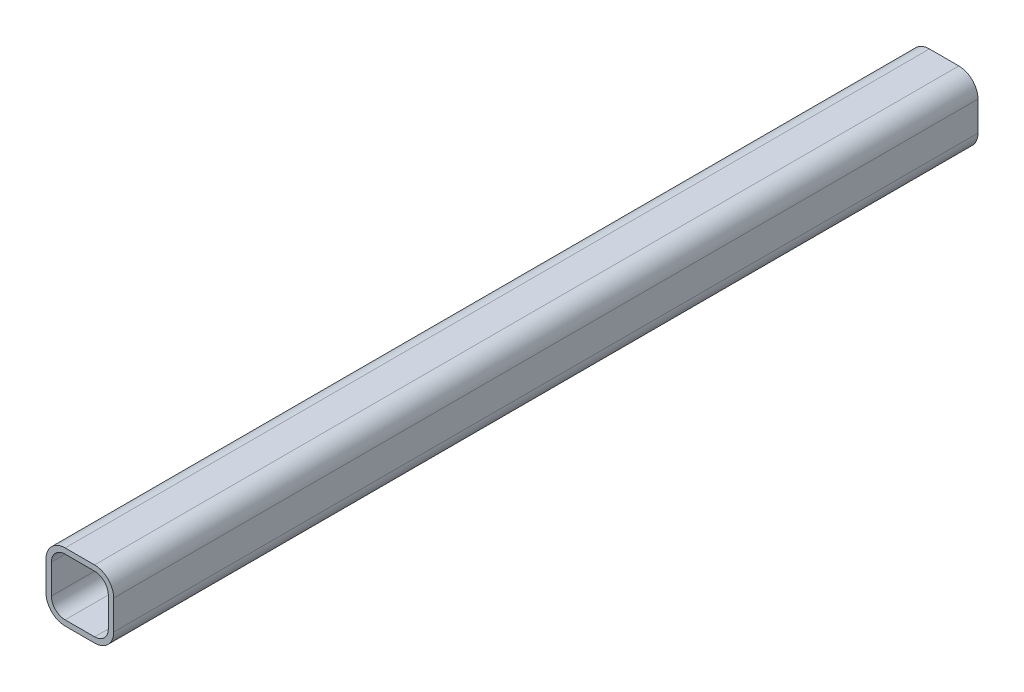
ISO-10303-21;
HEADER;
FILE_DESCRIPTION(('STEP AP214'),'2;1');
FILE_NAME('part.step','',(''),(''),'','','');
FILE_SCHEMA(('AUTOMOTIVE_DESIGN { 1 0 10303 214 1 1 1 1 }'));
ENDSEC;
DATA;
#1=APPLICATION_CONTEXT('core data for automotive mechanical design processes');
#2=APPLICATION_PROTOCOL_DEFINITION('international standard','automotive_design',2000,#1);
#3=PRODUCT_CONTEXT('',#1,'mechanical');
#4=PRODUCT('Part','Part','',(#3));
#5=PRODUCT_RELATED_PRODUCT_CATEGORY('part','',(#4));
#6=PRODUCT_DEFINITION_FORMATION('','',#4);
#7=PRODUCT_DEFINITION_CONTEXT('part definition',#1,'design');
#8=PRODUCT_DEFINITION('design','',#6,#7);
#9=PRODUCT_DEFINITION_SHAPE('','',#8);
#10=(LENGTH_UNIT() NAMED_UNIT(*) SI_UNIT(.MILLI.,.METRE.));
#11=(NAMED_UNIT(*) PLANE_ANGLE_UNIT() SI_UNIT($,.RADIAN.));
#12=(NAMED_UNIT(*) SI_UNIT($,.STERADIAN.) SOLID_ANGLE_UNIT());
#13=UNCERTAINTY_MEASURE_WITH_UNIT(LENGTH_MEASURE(1.E-05),#10,'distance_accuracy_value','');
#14=(GEOMETRIC_REPRESENTATION_CONTEXT(3) GLOBAL_UNCERTAINTY_ASSIGNED_CONTEXT((#13)) GLOBAL_UNIT_ASSIGNED_CONTEXT((#10,
#11,#12)) REPRESENTATION_CONTEXT('',''));
#15=CARTESIAN_POINT('',(0.,0.,0.));
#16=DIRECTION('',(0.,0.,1.));
#17=DIRECTION('',(1.,0.,0.));
#18=AXIS2_PLACEMENT_3D('',#15,#16,#17);
#19=CARTESIAN_POINT('',(-11.938,-11.938,-152.4));
#20=DIRECTION('',(0.,0.,1.));
#21=DIRECTION('',(1.,0.,0.));
#22=AXIS2_PLACEMENT_3D('',#19,#20,#21);
#23=PLANE('',#22);
#24=DIRECTION('',(0.,1.,0.));
#25=VECTOR('',#24,1.);
#26=CARTESIAN_POINT('',(-10.033,0.,-152.4));
#27=LINE('',#26,#25);
#28=CARTESIAN_POINT('',(-10.033,-5.19112500043521,-152.4));
#29=VERTEX_POINT('',#28);
#30=CARTESIAN_POINT('',(-10.033,5.19112499999956,-152.4));
#31=VERTEX_POINT('',#30);
#32=EDGE_CURVE('E157',#29,#31,#27,.T.);
#33=ORIENTED_EDGE('',*,*,#32,.F.);
#34=CARTESIAN_POINT('',(-5.191125,-5.19112500000087,-152.4));
#35=DIRECTION('',(0.,0.,-1.));
#36=DIRECTION('',(0.,1.,0.));
#37=AXIS2_PLACEMENT_3D('',#34,#35,#36);
#38=CIRCLE('',#37,4.841875);
#39=CARTESIAN_POINT('',(-5.19112499906869,-10.033,-152.4));
#40=VERTEX_POINT('',#39);
#41=EDGE_CURVE('E208',#40,#29,#38,.T.);
#42=ORIENTED_EDGE('',*,*,#41,.F.);
#43=DIRECTION('',(-1.,0.,0.));
#44=VECTOR('',#43,1.);
#45=CARTESIAN_POINT('',(0.,-10.033,-152.4));
#46=LINE('',#45,#44);
#47=CARTESIAN_POINT('',(5.191125,-10.033,-152.4));
#48=VERTEX_POINT('',#47);
#49=EDGE_CURVE('E153',#48,#40,#46,.T.);
#50=ORIENTED_EDGE('',*,*,#49,.F.);
#51=CARTESIAN_POINT('',(5.191125,-5.19112500000087,-152.4));
#52=DIRECTION('',(0.,0.,-1.));
#53=DIRECTION('',(0.,1.,0.));
#54=AXIS2_PLACEMENT_3D('',#51,#52,#53);
#55=CIRCLE('',#54,4.841875);
#56=CARTESIAN_POINT('',(10.033,-5.19112500099352,-152.4));
#57=VERTEX_POINT('',#56);
#58=EDGE_CURVE('E212',#57,#48,#55,.T.);
#59=ORIENTED_EDGE('',*,*,#58,.F.);
#60=DIRECTION('',(0.,-1.,0.));
#61=VECTOR('',#60,1.);
#62=CARTESIAN_POINT('',(10.033,0.,-152.4));
#63=LINE('',#62,#61);
#64=CARTESIAN_POINT('',(10.033,5.19112499999956,-152.4));
#65=VERTEX_POINT('',#64);
#66=EDGE_CURVE('E162',#65,#57,#63,.T.);
#67=ORIENTED_EDGE('',*,*,#66,.F.);
#68=CARTESIAN_POINT('',(5.191125,5.19112499999913,-152.4));
#69=DIRECTION('',(0.,0.,-1.));
#70=DIRECTION('',(0.,1.,0.));
#71=AXIS2_PLACEMENT_3D('',#68,#69,#70);
#72=CIRCLE('',#71,4.841875);
#73=CARTESIAN_POINT('',(5.19112500049654,10.033,-152.4));
#74=VERTEX_POINT('',#73);
#75=EDGE_CURVE('E215',#74,#65,#72,.T.);
#76=ORIENTED_EDGE('',*,*,#75,.F.);
#77=DIRECTION('',(1.,0.,0.));
#78=VECTOR('',#77,1.);
#79=CARTESIAN_POINT('',(0.,10.033,-152.4));
#80=LINE('',#79,#78);
#81=CARTESIAN_POINT('',(-5.191125,10.033,-152.4));
#82=VERTEX_POINT('',#81);
#83=EDGE_CURVE('E167',#82,#74,#80,.T.);
#84=ORIENTED_EDGE('',*,*,#83,.F.);
#85=CARTESIAN_POINT('',(-5.191125,5.19112499999913,-152.4));
#86=DIRECTION('',(0.,0.,-1.));
#87=DIRECTION('',(0.,1.,0.));
#88=AXIS2_PLACEMENT_3D('',#85,#86,#87);
#89=CIRCLE('',#88,4.841875);
#90=EDGE_CURVE('E160',#31,#82,#89,.T.);
#91=ORIENTED_EDGE('',*,*,#90,.F.);
#92=EDGE_LOOP('',(#33,#42,#50,#59,#67,#76,#84,#91));
#93=FACE_BOUND('',#92,.T.);
#94=DIRECTION('',(0.,-1.,0.));
#95=VECTOR('',#94,1.);
#96=CARTESIAN_POINT('',(11.938,0.,-152.4));
#97=LINE('',#96,#95);
#98=CARTESIAN_POINT('',(11.938,5.19112499999969,-152.4));
#99=VERTEX_POINT('',#98);
#100=CARTESIAN_POINT('',(11.938,-5.19112500000031,-152.4));
#101=VERTEX_POINT('',#100);
#102=EDGE_CURVE('E161',#99,#101,#97,.T.);
#103=ORIENTED_EDGE('',*,*,#102,.T.);
#104=CARTESIAN_POINT('',(5.191125,-5.19112500000063,-152.4));
#105=DIRECTION('',(0.,0.,-1.));
#106=DIRECTION('',(0.,1.,0.));
#107=AXIS2_PLACEMENT_3D('',#104,#105,#106);
#108=CIRCLE('',#107,6.746875);
#109=CARTESIAN_POINT('',(5.19112500129773,-11.938,-152.4));
#110=VERTEX_POINT('',#109);
#111=EDGE_CURVE('E220',#101,#110,#108,.T.);
#112=ORIENTED_EDGE('',*,*,#111,.T.);
#113=DIRECTION('',(-1.,0.,0.));
#114=VECTOR('',#113,1.);
#115=CARTESIAN_POINT('',(0.,-11.938,-152.4));
#116=LINE('',#115,#114);
#117=CARTESIAN_POINT('',(-5.191125,-11.938,-152.4));
#118=VERTEX_POINT('',#117);
#119=EDGE_CURVE('E173',#110,#118,#116,.T.);
#120=ORIENTED_EDGE('',*,*,#119,.T.);
#121=CARTESIAN_POINT('',(-5.191125,-5.19112500000063,-152.4));
#122=DIRECTION('',(0.,0.,-1.));
#123=DIRECTION('',(0.,1.,0.));
#124=AXIS2_PLACEMENT_3D('',#121,#122,#123);
#125=CIRCLE('',#124,6.746875);
#126=CARTESIAN_POINT('',(-11.938,-5.19112500060614,-152.4));
#127=VERTEX_POINT('',#126);
#128=EDGE_CURVE('E224',#118,#127,#125,.T.);
#129=ORIENTED_EDGE('',*,*,#128,.T.);
#130=DIRECTION('',(0.,1.,0.));
#131=VECTOR('',#130,1.);
#132=CARTESIAN_POINT('',(-11.938,0.,-152.4));
#133=LINE('',#132,#131);
#134=CARTESIAN_POINT('',(-11.938,5.19112499999969,-152.4));
#135=VERTEX_POINT('',#134);
#136=EDGE_CURVE('E178',#127,#135,#133,.T.);
#137=ORIENTED_EDGE('',*,*,#136,.T.);
#138=CARTESIAN_POINT('',(-5.191125,5.19112499999937,-152.4));
#139=DIRECTION('',(0.,0.,-1.));
#140=DIRECTION('',(0.,1.,0.));
#141=AXIS2_PLACEMENT_3D('',#138,#139,#140);
#142=CIRCLE('',#141,6.746875);
#143=CARTESIAN_POINT('',(-5.1911249993081,11.938,-152.4));
#144=VERTEX_POINT('',#143);
#145=EDGE_CURVE('E140',#135,#144,#142,.T.);
#146=ORIENTED_EDGE('',*,*,#145,.T.);
#147=DIRECTION('',(1.,0.,0.));
#148=VECTOR('',#147,1.);
#149=CARTESIAN_POINT('',(0.,11.938,-152.4));
#150=LINE('',#149,#148);
#151=CARTESIAN_POINT('',(5.191125,11.938,-152.4));
#152=VERTEX_POINT('',#151);
#153=EDGE_CURVE('E138',#144,#152,#150,.T.);
#154=ORIENTED_EDGE('',*,*,#153,.T.);
#155=CARTESIAN_POINT('',(5.191125,5.19112499999937,-152.4));
#156=DIRECTION('',(0.,0.,-1.));
#157=DIRECTION('',(0.,1.,0.));
#158=AXIS2_PLACEMENT_3D('',#155,#156,#157);
#159=CIRCLE('',#158,6.746875);
#160=EDGE_CURVE('E19',#152,#99,#159,.T.);
#161=ORIENTED_EDGE('',*,*,#160,.T.);
#162=EDGE_LOOP('',(#103,#112,#120,#129,#137,#146,#154,#161));
#163=FACE_BOUND('',#162,.T.);
#164=ADVANCED_FACE('F15',(#93,#163),#23,.F.);
#165=CARTESIAN_POINT('',(5.191125,5.191125,152.4));
#166=DIRECTION('',(0.,0.,-1.));
#167=DIRECTION('',(0.,1.,0.));
#168=AXIS2_PLACEMENT_3D('',#165,#166,#167);
#169=CYLINDRICAL_SURFACE('',#168,6.746875);
#170=DIRECTION('',(0.,0.,1.));
#171=VECTOR('',#170,1.);
#172=CARTESIAN_POINT('',(5.191125,11.938,0.));
#173=LINE('',#172,#171);
#174=CARTESIAN_POINT('',(5.191125,11.938,152.4));
#175=VERTEX_POINT('',#174);
#176=EDGE_CURVE('E130',#152,#175,#173,.T.);
#177=ORIENTED_EDGE('',*,*,#176,.T.);
#178=CARTESIAN_POINT('',(5.191125,5.191125,152.4));
#179=DIRECTION('',(0.,0.,-1.));
#180=DIRECTION('',(0.,1.,0.));
#181=AXIS2_PLACEMENT_3D('',#178,#179,#180);
#182=CIRCLE('',#181,6.746875);
#183=CARTESIAN_POINT('',(11.938,5.191125,152.4));
#184=VERTEX_POINT('',#183);
#185=EDGE_CURVE('E206',#184,#175,#182,.F.);
#186=ORIENTED_EDGE('',*,*,#185,.F.);
#187=DIRECTION('',(0.,0.,-1.));
#188=VECTOR('',#187,1.);
#189=CARTESIAN_POINT('',(11.938,5.191125,0.));
#190=LINE('',#189,#188);
#191=EDGE_CURVE('E133',#184,#99,#190,.T.);
#192=ORIENTED_EDGE('',*,*,#191,.T.);
#193=ORIENTED_EDGE('',*,*,#160,.F.);
#194=EDGE_LOOP('',(#177,#186,#192,#193));
#195=FACE_BOUND('',#194,.T.);
#196=ADVANCED_FACE('F128',(#195),#169,.T.);
#197=CARTESIAN_POINT('',(-5.191125,11.938,152.4));
#198=DIRECTION('',(0.,-1.,0.));
#199=DIRECTION('',(0.,0.,-1.));
#200=AXIS2_PLACEMENT_3D('',#197,#198,#199);
#201=PLANE('',#200);
#202=DIRECTION('',(0.,0.,-1.));
#203=VECTOR('',#202,1.);
#204=CARTESIAN_POINT('',(-5.19112499861619,11.938,0.));
#205=LINE('',#204,#203);
#206=CARTESIAN_POINT('',(-5.1911249993081,11.938,152.4));
#207=VERTEX_POINT('',#206);
#208=EDGE_CURVE('E143',#144,#207,#205,.F.);
#209=ORIENTED_EDGE('',*,*,#208,.T.);
#210=DIRECTION('',(-1.,0.,0.));
#211=VECTOR('',#210,1.);
#212=CARTESIAN_POINT('',(0.,11.938,152.4));
#213=LINE('',#212,#211);
#214=EDGE_CURVE('E147',#175,#207,#213,.T.);
#215=ORIENTED_EDGE('',*,*,#214,.F.);
#216=ORIENTED_EDGE('',*,*,#176,.F.);
#217=ORIENTED_EDGE('',*,*,#153,.F.);
#218=EDGE_LOOP('',(#209,#215,#216,#217));
#219=FACE_BOUND('',#218,.T.);
#220=ADVANCED_FACE('F145',(#219),#201,.F.);
#221=CARTESIAN_POINT('',(-5.191125,5.191125,152.4));
#222=DIRECTION('',(0.,0.,-1.));
#223=DIRECTION('',(0.,1.,0.));
#224=AXIS2_PLACEMENT_3D('',#221,#222,#223);
#225=CYLINDRICAL_SURFACE('',#224,6.746875);
#226=DIRECTION('',(0.,0.,1.));
#227=VECTOR('',#226,1.);
#228=CARTESIAN_POINT('',(-11.938,5.191125,0.));
#229=LINE('',#228,#227);
#230=CARTESIAN_POINT('',(-11.938,5.191125,152.4));
#231=VERTEX_POINT('',#230);
#232=EDGE_CURVE('E180',#135,#231,#229,.T.);
#233=ORIENTED_EDGE('',*,*,#232,.T.);
#234=CARTESIAN_POINT('',(-5.191125,5.191125,152.4));
#235=DIRECTION('',(0.,0.,-1.));
#236=DIRECTION('',(0.,1.,0.));
#237=AXIS2_PLACEMENT_3D('',#234,#235,#236);
#238=CIRCLE('',#237,6.746875);
#239=EDGE_CURVE('E203',#207,#231,#238,.F.);
#240=ORIENTED_EDGE('',*,*,#239,.F.);
#241=ORIENTED_EDGE('',*,*,#208,.F.);
#242=ORIENTED_EDGE('',*,*,#145,.F.);
#243=EDGE_LOOP('',(#233,#240,#241,#242));
#244=FACE_BOUND('',#243,.T.);
#245=ADVANCED_FACE('F228',(#244),#225,.T.);
#246=CARTESIAN_POINT('',(-11.938,-5.191125,152.4));
#247=DIRECTION('',(1.,0.,0.));
#248=DIRECTION('',(0.,0.,-1.));
#249=AXIS2_PLACEMENT_3D('',#246,#247,#248);
#250=PLANE('',#249);
#251=DIRECTION('',(0.,0.,-1.));
#252=VECTOR('',#251,1.);
#253=CARTESIAN_POINT('',(-11.938,-5.19112500121165,0.));
#254=LINE('',#253,#252);
#255=CARTESIAN_POINT('',(-11.938,-5.19112500060583,152.4));
#256=VERTEX_POINT('',#255);
#257=EDGE_CURVE('E179',#127,#256,#254,.F.);
#258=ORIENTED_EDGE('',*,*,#257,.T.);
#259=DIRECTION('',(0.,-1.,0.));
#260=VECTOR('',#259,1.);
#261=CARTESIAN_POINT('',(-11.938,0.,152.4));
#262=LINE('',#261,#260);
#263=EDGE_CURVE('E202',#231,#256,#262,.T.);
#264=ORIENTED_EDGE('',*,*,#263,.F.);
#265=ORIENTED_EDGE('',*,*,#232,.F.);
#266=ORIENTED_EDGE('',*,*,#136,.F.);
#267=EDGE_LOOP('',(#258,#264,#265,#266));
#268=FACE_BOUND('',#267,.T.);
#269=ADVANCED_FACE('F260',(#268),#250,.F.);
#270=CARTESIAN_POINT('',(-5.191125,-5.191125,152.4));
#271=DIRECTION('',(0.,0.,-1.));
#272=DIRECTION('',(0.,1.,0.));
#273=AXIS2_PLACEMENT_3D('',#270,#271,#272);
#274=CYLINDRICAL_SURFACE('',#273,6.746875);
#275=DIRECTION('',(0.,0.,1.));
#276=VECTOR('',#275,1.);
#277=CARTESIAN_POINT('',(-5.191125,-11.938,0.));
#278=LINE('',#277,#276);
#279=CARTESIAN_POINT('',(-5.191125,-11.938,152.4));
#280=VERTEX_POINT('',#279);
#281=EDGE_CURVE('E177',#118,#280,#278,.T.);
#282=ORIENTED_EDGE('',*,*,#281,.T.);
#283=CARTESIAN_POINT('',(-5.191125,-5.191125,152.4));
#284=DIRECTION('',(0.,0.,-1.));
#285=DIRECTION('',(0.,1.,0.));
#286=AXIS2_PLACEMENT_3D('',#283,#284,#285);
#287=CIRCLE('',#286,6.746875);
#288=EDGE_CURVE('E199',#256,#280,#287,.F.);
#289=ORIENTED_EDGE('',*,*,#288,.F.);
#290=ORIENTED_EDGE('',*,*,#257,.F.);
#291=ORIENTED_EDGE('',*,*,#128,.F.);
#292=EDGE_LOOP('',(#282,#289,#290,#291));
#293=FACE_BOUND('',#292,.T.);
#294=ADVANCED_FACE('F262',(#293),#274,.T.);
#295=CARTESIAN_POINT('',(-5.191125,-11.938,-152.4));
#296=DIRECTION('',(0.,1.,0.));
#297=DIRECTION('',(0.,0.,1.));
#298=AXIS2_PLACEMENT_3D('',#295,#296,#297);
#299=PLANE('',#298);
#300=DIRECTION('',(0.,0.,-1.));
#301=VECTOR('',#300,1.);
#302=CARTESIAN_POINT('',(5.19112500259545,-11.938,0.));
#303=LINE('',#302,#301);
#304=CARTESIAN_POINT('',(5.19112500129773,-11.938,152.4));
#305=VERTEX_POINT('',#304);
#306=EDGE_CURVE('E176',#110,#305,#303,.F.);
#307=ORIENTED_EDGE('',*,*,#306,.T.);
#308=DIRECTION('',(1.,0.,0.));
#309=VECTOR('',#308,1.);
#310=CARTESIAN_POINT('',(0.,-11.938,152.4));
#311=LINE('',#310,#309);
#312=EDGE_CURVE('E198',#280,#305,#311,.T.);
#313=ORIENTED_EDGE('',*,*,#312,.F.);
#314=ORIENTED_EDGE('',*,*,#281,.F.);
#315=ORIENTED_EDGE('',*,*,#119,.F.);
#316=EDGE_LOOP('',(#307,#313,#314,#315));
#317=FACE_BOUND('',#316,.T.);
#318=ADVANCED_FACE('F318',(#317),#299,.F.);
#319=CARTESIAN_POINT('',(5.191125,-5.191125,152.4));
#320=DIRECTION('',(0.,0.,-1.));
#321=DIRECTION('',(0.,1.,0.));
#322=AXIS2_PLACEMENT_3D('',#319,#320,#321);
#323=CYLINDRICAL_SURFACE('',#322,6.746875);
#324=DIRECTION('',(0.,0.,1.));
#325=VECTOR('',#324,1.);
#326=CARTESIAN_POINT('',(11.938,-5.191125,0.));
#327=LINE('',#326,#325);
#328=CARTESIAN_POINT('',(11.938,-5.191125,152.4));
#329=VERTEX_POINT('',#328);
#330=EDGE_CURVE('E223',#101,#329,#327,.T.);
#331=ORIENTED_EDGE('',*,*,#330,.T.);
#332=CARTESIAN_POINT('',(5.191125,-5.191125,152.4));
#333=DIRECTION('',(0.,0.,-1.));
#334=DIRECTION('',(0.,1.,0.));
#335=AXIS2_PLACEMENT_3D('',#332,#333,#334);
#336=CIRCLE('',#335,6.746875);
#337=EDGE_CURVE('E194',#305,#329,#336,.F.);
#338=ORIENTED_EDGE('',*,*,#337,.F.);
#339=ORIENTED_EDGE('',*,*,#306,.F.);
#340=ORIENTED_EDGE('',*,*,#111,.F.);
#341=EDGE_LOOP('',(#331,#338,#339,#340));
#342=FACE_BOUND('',#341,.T.);
#343=ADVANCED_FACE('F314',(#342),#323,.T.);
#344=CARTESIAN_POINT('',(11.938,-5.191125,-152.4));
#345=DIRECTION('',(-1.,0.,0.));
#346=DIRECTION('',(0.,0.,1.));
#347=AXIS2_PLACEMENT_3D('',#344,#345,#346);
#348=PLANE('',#347);
#349=ORIENTED_EDGE('',*,*,#191,.F.);
#350=DIRECTION('',(0.,1.,0.));
#351=VECTOR('',#350,1.);
#352=CARTESIAN_POINT('',(11.938,0.,152.4));
#353=LINE('',#352,#351);
#354=EDGE_CURVE('E197',#329,#184,#353,.T.);
#355=ORIENTED_EDGE('',*,*,#354,.F.);
#356=ORIENTED_EDGE('',*,*,#330,.F.);
#357=ORIENTED_EDGE('',*,*,#102,.F.);
#358=EDGE_LOOP('',(#349,#355,#356,#357));
#359=FACE_BOUND('',#358,.T.);
#360=ADVANCED_FACE('F317',(#359),#348,.F.);
#361=CARTESIAN_POINT('',(-10.033,-5.191125,152.4));
#362=DIRECTION('',(1.,0.,0.));
#363=DIRECTION('',(0.,0.,-1.));
#364=AXIS2_PLACEMENT_3D('',#361,#362,#363);
#365=PLANE('',#364);
#366=DIRECTION('',(0.,1.,0.));
#367=VECTOR('',#366,1.);
#368=CARTESIAN_POINT('',(-10.033000001016,0.,152.4));
#369=LINE('',#368,#367);
#370=CARTESIAN_POINT('',(-10.033000000508,-5.19112500043477,152.4));
#371=VERTEX_POINT('',#370);
#372=CARTESIAN_POINT('',(-10.033000000508,5.191125,152.4));
#373=VERTEX_POINT('',#372);
#374=EDGE_CURVE('E193',#371,#373,#369,.T.);
#375=ORIENTED_EDGE('',*,*,#374,.F.);
#376=DIRECTION('',(0.,0.,-1.));
#377=VECTOR('',#376,1.);
#378=CARTESIAN_POINT('',(-10.033,-5.19112500086954,0.));
#379=LINE('',#378,#377);
#380=EDGE_CURVE('E211',#29,#371,#379,.F.);
#381=ORIENTED_EDGE('',*,*,#380,.F.);
#382=ORIENTED_EDGE('',*,*,#32,.T.);
#383=DIRECTION('',(0.,0.,1.));
#384=VECTOR('',#383,1.);
#385=CARTESIAN_POINT('',(-10.033,5.191125,0.));
#386=LINE('',#385,#384);
#387=EDGE_CURVE('E171',#373,#31,#386,.F.);
#388=ORIENTED_EDGE('',*,*,#387,.F.);
#389=EDGE_LOOP('',(#375,#381,#382,#388));
#390=FACE_BOUND('',#389,.T.);
#391=ADVANCED_FACE('F297',(#390),#365,.T.);
#392=CARTESIAN_POINT('',(-5.191125,5.191125,152.4));
#393=DIRECTION('',(0.,0.,-1.));
#394=DIRECTION('',(0.,1.,0.));
#395=AXIS2_PLACEMENT_3D('',#392,#393,#394);
#396=CYLINDRICAL_SURFACE('',#395,4.841875);
#397=CARTESIAN_POINT('',(-5.191125,5.191125,152.4));
#398=DIRECTION('',(0.,0.,-1.));
#399=DIRECTION('',(0.,1.,0.));
#400=AXIS2_PLACEMENT_3D('',#397,#398,#399);
#401=CIRCLE('',#400,4.841875);
#402=CARTESIAN_POINT('',(-5.191125,10.033000000508,152.4));
#403=VERTEX_POINT('',#402);
#404=EDGE_CURVE('E190',#373,#403,#401,.T.);
#405=ORIENTED_EDGE('',*,*,#404,.F.);
#406=ORIENTED_EDGE('',*,*,#387,.T.);
#407=ORIENTED_EDGE('',*,*,#90,.T.);
#408=DIRECTION('',(0.,0.,-1.));
#409=VECTOR('',#408,1.);
#410=CARTESIAN_POINT('',(-5.191125,10.033,0.));
#411=LINE('',#410,#409);
#412=EDGE_CURVE('E170',#403,#82,#411,.T.);
#413=ORIENTED_EDGE('',*,*,#412,.F.);
#414=EDGE_LOOP('',(#405,#406,#407,#413));
#415=FACE_BOUND('',#414,.T.);
#416=ADVANCED_FACE('F294',(#415),#396,.F.);
#417=CARTESIAN_POINT('',(-5.191125,10.033,152.4));
#418=DIRECTION('',(0.,-1.,0.));
#419=DIRECTION('',(0.,0.,-1.));
#420=AXIS2_PLACEMENT_3D('',#417,#418,#419);
#421=PLANE('',#420);
#422=DIRECTION('',(1.,0.,0.));
#423=VECTOR('',#422,1.);
#424=CARTESIAN_POINT('',(0.,10.033000001016,152.4));
#425=LINE('',#424,#423);
#426=CARTESIAN_POINT('',(5.19112500049654,10.033000000508,152.4));
#427=VERTEX_POINT('',#426);
#428=EDGE_CURVE('E189',#403,#427,#425,.T.);
#429=ORIENTED_EDGE('',*,*,#428,.F.);
#430=ORIENTED_EDGE('',*,*,#412,.T.);
#431=ORIENTED_EDGE('',*,*,#83,.T.);
#432=DIRECTION('',(0.,0.,1.));
#433=VECTOR('',#432,1.);
#434=CARTESIAN_POINT('',(5.19112500099309,10.033,0.));
#435=LINE('',#434,#433);
#436=EDGE_CURVE('E166',#427,#74,#435,.F.);
#437=ORIENTED_EDGE('',*,*,#436,.F.);
#438=EDGE_LOOP('',(#429,#430,#431,#437));
#439=FACE_BOUND('',#438,.T.);
#440=ADVANCED_FACE('F291',(#439),#421,.T.);
#441=CARTESIAN_POINT('',(5.191125,5.191125,152.4));
#442=DIRECTION('',(0.,0.,-1.));
#443=DIRECTION('',(0.,1.,0.));
#444=AXIS2_PLACEMENT_3D('',#441,#442,#443);
#445=CYLINDRICAL_SURFACE('',#444,4.841875);
#446=CARTESIAN_POINT('',(5.191125,5.191125,152.4));
#447=DIRECTION('',(0.,0.,-1.));
#448=DIRECTION('',(0.,1.,0.));
#449=AXIS2_PLACEMENT_3D('',#446,#447,#448);
#450=CIRCLE('',#449,4.841875);
#451=CARTESIAN_POINT('',(10.033000000508,5.191125,152.4));
#452=VERTEX_POINT('',#451);
#453=EDGE_CURVE('E186',#427,#452,#450,.T.);
#454=ORIENTED_EDGE('',*,*,#453,.F.);
#455=ORIENTED_EDGE('',*,*,#436,.T.);
#456=ORIENTED_EDGE('',*,*,#75,.T.);
#457=DIRECTION('',(0.,0.,-1.));
#458=VECTOR('',#457,1.);
#459=CARTESIAN_POINT('',(10.033,5.191125,0.));
#460=LINE('',#459,#458);
#461=EDGE_CURVE('E165',#452,#65,#460,.T.);
#462=ORIENTED_EDGE('',*,*,#461,.F.);
#463=EDGE_LOOP('',(#454,#455,#456,#462));
#464=FACE_BOUND('',#463,.T.);
#465=ADVANCED_FACE('F288',(#464),#445,.F.);
#466=CARTESIAN_POINT('',(10.033,-5.191125,-152.4));
#467=DIRECTION('',(-1.,0.,0.));
#468=DIRECTION('',(0.,0.,1.));
#469=AXIS2_PLACEMENT_3D('',#466,#467,#468);
#470=PLANE('',#469);
#471=DIRECTION('',(0.,-1.,0.));
#472=VECTOR('',#471,1.);
#473=CARTESIAN_POINT('',(10.033000001016,0.,152.4));
#474=LINE('',#473,#472);
#475=CARTESIAN_POINT('',(10.033000000508,-5.19112500099309,152.4));
#476=VERTEX_POINT('',#475);
#477=EDGE_CURVE('E185',#452,#476,#474,.T.);
#478=ORIENTED_EDGE('',*,*,#477,.F.);
#479=ORIENTED_EDGE('',*,*,#461,.T.);
#480=ORIENTED_EDGE('',*,*,#66,.T.);
#481=DIRECTION('',(0.,0.,1.));
#482=VECTOR('',#481,1.);
#483=CARTESIAN_POINT('',(10.033,-5.19112500198617,0.));
#484=LINE('',#483,#482);
#485=EDGE_CURVE('E156',#476,#57,#484,.F.);
#486=ORIENTED_EDGE('',*,*,#485,.F.);
#487=EDGE_LOOP('',(#478,#479,#480,#486));
#488=FACE_BOUND('',#487,.T.);
#489=ADVANCED_FACE('F285',(#488),#470,.T.);
#490=CARTESIAN_POINT('',(5.191125,-5.191125,152.4));
#491=DIRECTION('',(0.,0.,-1.));
#492=DIRECTION('',(0.,1.,0.));
#493=AXIS2_PLACEMENT_3D('',#490,#491,#492);
#494=CYLINDRICAL_SURFACE('',#493,4.841875);
#495=CARTESIAN_POINT('',(5.191125,-5.191125,152.4));
#496=DIRECTION('',(0.,0.,-1.));
#497=DIRECTION('',(0.,1.,0.));
#498=AXIS2_PLACEMENT_3D('',#495,#496,#497);
#499=CIRCLE('',#498,4.841875);
#500=CARTESIAN_POINT('',(5.191125,-10.033000000508,152.4));
#501=VERTEX_POINT('',#500);
#502=EDGE_CURVE('E182',#476,#501,#499,.T.);
#503=ORIENTED_EDGE('',*,*,#502,.F.);
#504=ORIENTED_EDGE('',*,*,#485,.T.);
#505=ORIENTED_EDGE('',*,*,#58,.T.);
#506=DIRECTION('',(0.,0.,-1.));
#507=VECTOR('',#506,1.);
#508=CARTESIAN_POINT('',(5.191125,-10.033,0.));
#509=LINE('',#508,#507);
#510=EDGE_CURVE('E155',#501,#48,#509,.T.);
#511=ORIENTED_EDGE('',*,*,#510,.F.);
#512=EDGE_LOOP('',(#503,#504,#505,#511));
#513=FACE_BOUND('',#512,.T.);
#514=ADVANCED_FACE('F281',(#513),#494,.F.);
#515=CARTESIAN_POINT('',(-5.191125,-10.033,-152.4));
#516=DIRECTION('',(0.,1.,0.));
#517=DIRECTION('',(0.,0.,1.));
#518=AXIS2_PLACEMENT_3D('',#515,#516,#517);
#519=PLANE('',#518);
#520=DIRECTION('',(-1.,0.,0.));
#521=VECTOR('',#520,1.);
#522=CARTESIAN_POINT('',(0.,-10.033000001016,152.4));
#523=LINE('',#522,#521);
#524=CARTESIAN_POINT('',(-5.19112499906869,-10.033000000508,152.4));
#525=VERTEX_POINT('',#524);
#526=EDGE_CURVE('E25',#501,#525,#523,.T.);
#527=ORIENTED_EDGE('',*,*,#526,.F.);
#528=ORIENTED_EDGE('',*,*,#510,.T.);
#529=ORIENTED_EDGE('',*,*,#49,.T.);
#530=DIRECTION('',(0.,0.,1.));
#531=VECTOR('',#530,1.);
#532=CARTESIAN_POINT('',(-5.19112499813738,-10.033,0.));
#533=LINE('',#532,#531);
#534=EDGE_CURVE('E34',#525,#40,#533,.F.);
#535=ORIENTED_EDGE('',*,*,#534,.F.);
#536=EDGE_LOOP('',(#527,#528,#529,#535));
#537=FACE_BOUND('',#536,.T.);
#538=ADVANCED_FACE('F279',(#537),#519,.T.);
#539=CARTESIAN_POINT('',(-5.191125,-5.191125,152.4));
#540=DIRECTION('',(0.,0.,-1.));
#541=DIRECTION('',(0.,1.,0.));
#542=AXIS2_PLACEMENT_3D('',#539,#540,#541);
#543=CYLINDRICAL_SURFACE('',#542,4.841875);
#544=CARTESIAN_POINT('',(-5.191125,-5.191125,152.4));
#545=DIRECTION('',(0.,0.,-1.));
#546=DIRECTION('',(0.,1.,0.));
#547=AXIS2_PLACEMENT_3D('',#544,#545,#546);
#548=CIRCLE('',#547,4.841875);
#549=EDGE_CURVE('E9',#525,#371,#548,.T.);
#550=ORIENTED_EDGE('',*,*,#549,.F.);
#551=ORIENTED_EDGE('',*,*,#534,.T.);
#552=ORIENTED_EDGE('',*,*,#41,.T.);
#553=ORIENTED_EDGE('',*,*,#380,.T.);
#554=EDGE_LOOP('',(#550,#551,#552,#553));
#555=FACE_BOUND('',#554,.T.);
#556=ADVANCED_FACE('F299',(#555),#543,.F.);
#557=CARTESIAN_POINT('',(-11.938,-11.938,152.4));
#558=DIRECTION('',(0.,0.,1.));
#559=DIRECTION('',(1.,0.,0.));
#560=AXIS2_PLACEMENT_3D('',#557,#558,#559);
#561=PLANE('',#560);
#562=ORIENTED_EDGE('',*,*,#526,.T.);
#563=ORIENTED_EDGE('',*,*,#549,.T.);
#564=ORIENTED_EDGE('',*,*,#374,.T.);
#565=ORIENTED_EDGE('',*,*,#404,.T.);
#566=ORIENTED_EDGE('',*,*,#428,.T.);
#567=ORIENTED_EDGE('',*,*,#453,.T.);
#568=ORIENTED_EDGE('',*,*,#477,.T.);
#569=ORIENTED_EDGE('',*,*,#502,.T.);
#570=EDGE_LOOP('',(#562,#563,#564,#565,#566,#567,#568,#569));
#571=FACE_BOUND('',#570,.T.);
#572=ORIENTED_EDGE('',*,*,#337,.T.);
#573=ORIENTED_EDGE('',*,*,#354,.T.);
#574=ORIENTED_EDGE('',*,*,#185,.T.);
#575=ORIENTED_EDGE('',*,*,#214,.T.);
#576=ORIENTED_EDGE('',*,*,#239,.T.);
#577=ORIENTED_EDGE('',*,*,#263,.T.);
#578=ORIENTED_EDGE('',*,*,#288,.T.);
#579=ORIENTED_EDGE('',*,*,#312,.T.);
#580=EDGE_LOOP('',(#572,#573,#574,#575,#576,#577,#578,#579));
#581=FACE_BOUND('',#580,.T.);
#582=ADVANCED_FACE('F17',(#571,#581),#561,.T.);
#583=CLOSED_SHELL('',(#164,#196,#220,#245,#269,#294,#318,#343,#360,#391,#416,#440,#465,#489,
#514,#538,#556,#582));
#584=MANIFOLD_SOLID_BREP('B1',#583);
#585=ADVANCED_BREP_SHAPE_REPRESENTATION('',(#18,#584),#14);
#586=SHAPE_DEFINITION_REPRESENTATION(#9,#585);
ENDSEC;
END-ISO-10303-21;
